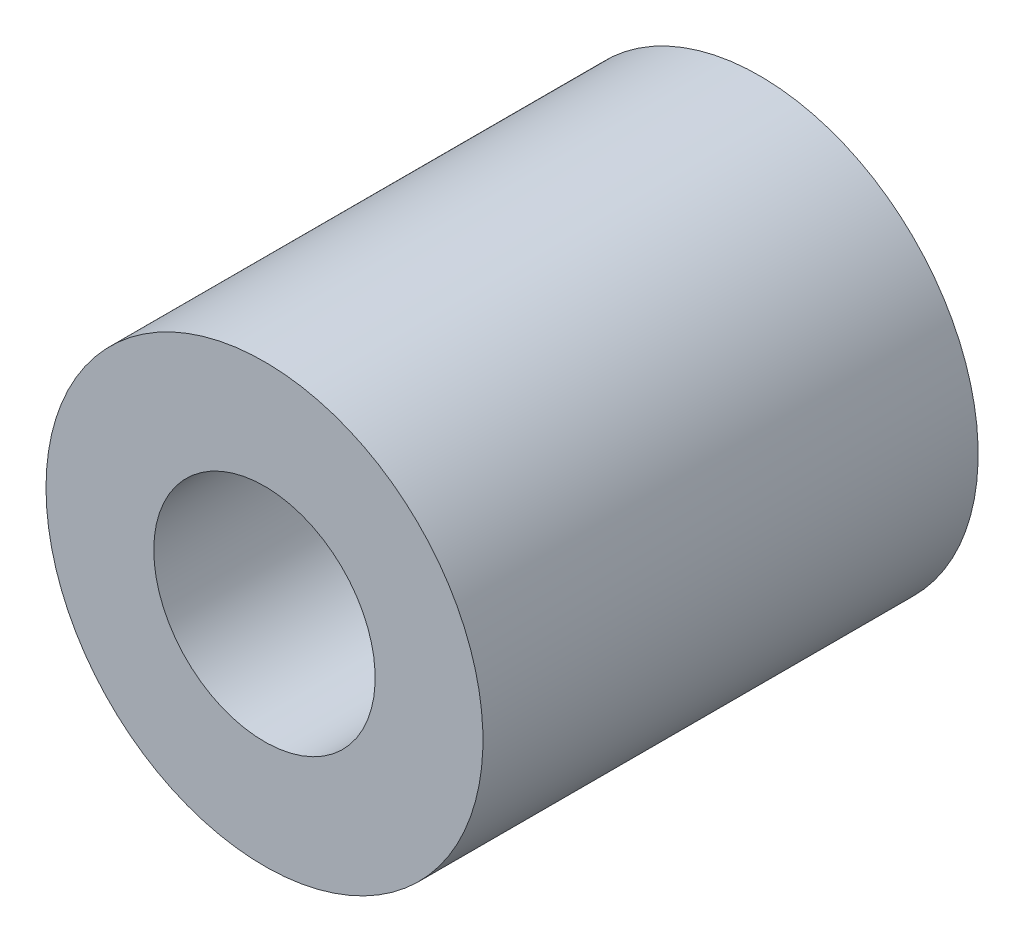
ISO-10303-21;
HEADER;
FILE_DESCRIPTION(('STEP AP214'),'2;1');
FILE_NAME('part.step','',(''),(''),'','','');
FILE_SCHEMA(('AUTOMOTIVE_DESIGN { 1 0 10303 214 1 1 1 1 }'));
ENDSEC;
DATA;
#1=APPLICATION_CONTEXT('core data for automotive mechanical design processes');
#2=APPLICATION_PROTOCOL_DEFINITION('international standard','automotive_design',2000,#1);
#3=PRODUCT_CONTEXT('',#1,'mechanical');
#4=PRODUCT('Part','Part','',(#3));
#5=PRODUCT_RELATED_PRODUCT_CATEGORY('part','',(#4));
#6=PRODUCT_DEFINITION_FORMATION('','',#4);
#7=PRODUCT_DEFINITION_CONTEXT('part definition',#1,'design');
#8=PRODUCT_DEFINITION('design','',#6,#7);
#9=PRODUCT_DEFINITION_SHAPE('','',#8);
#10=(LENGTH_UNIT() NAMED_UNIT(*) SI_UNIT(.MILLI.,.METRE.));
#11=(NAMED_UNIT(*) PLANE_ANGLE_UNIT() SI_UNIT($,.RADIAN.));
#12=(NAMED_UNIT(*) SI_UNIT($,.STERADIAN.) SOLID_ANGLE_UNIT());
#13=UNCERTAINTY_MEASURE_WITH_UNIT(LENGTH_MEASURE(1.E-05),#10,'distance_accuracy_value','');
#14=(GEOMETRIC_REPRESENTATION_CONTEXT(3) GLOBAL_UNCERTAINTY_ASSIGNED_CONTEXT((#13)) GLOBAL_UNIT_ASSIGNED_CONTEXT((#10,
#11,#12)) REPRESENTATION_CONTEXT('',''));
#15=CARTESIAN_POINT('',(0.,0.,0.));
#16=DIRECTION('',(0.,0.,1.));
#17=DIRECTION('',(1.,0.,0.));
#18=AXIS2_PLACEMENT_3D('',#15,#16,#17);
#19=CARTESIAN_POINT('',(0.,0.,21.59));
#20=DIRECTION('',(0.,0.,-1.));
#21=DIRECTION('',(-1.,0.,0.));
#22=AXIS2_PLACEMENT_3D('',#19,#20,#21);
#23=CYLINDRICAL_SURFACE('',#22,4.826);
#24=CARTESIAN_POINT('',(0.,0.,0.));
#25=DIRECTION('',(0.,0.,-1.));
#26=DIRECTION('',(-1.,0.,0.));
#27=AXIS2_PLACEMENT_3D('',#24,#25,#26);
#28=CIRCLE('',#27,4.826);
#29=CARTESIAN_POINT('',(-4.826,0.,0.));
#30=VERTEX_POINT('',#29);
#31=EDGE_CURVE('E26',#30,#30,#28,.T.);
#32=ORIENTED_EDGE('',*,*,#31,.T.);
#33=EDGE_LOOP('',(#32));
#34=FACE_BOUND('',#33,.T.);
#35=CARTESIAN_POINT('',(0.,0.,21.59));
#36=DIRECTION('',(0.,0.,-1.));
#37=DIRECTION('',(-1.,0.,0.));
#38=AXIS2_PLACEMENT_3D('',#35,#36,#37);
#39=CIRCLE('',#38,4.826);
#40=CARTESIAN_POINT('',(-4.826,0.,21.59));
#41=VERTEX_POINT('',#40);
#42=EDGE_CURVE('E17',#41,#41,#39,.T.);
#43=ORIENTED_EDGE('',*,*,#42,.F.);
#44=EDGE_LOOP('',(#43));
#45=FACE_BOUND('',#44,.T.);
#46=ADVANCED_FACE('F14',(#34,#45),#23,.F.);
#47=CARTESIAN_POINT('',(0.,0.,21.59));
#48=DIRECTION('',(0.,0.,1.));
#49=DIRECTION('',(1.,0.,0.));
#50=AXIS2_PLACEMENT_3D('',#47,#48,#49);
#51=PLANE('',#50);
#52=ORIENTED_EDGE('',*,*,#42,.T.);
#53=EDGE_LOOP('',(#52));
#54=FACE_BOUND('',#53,.T.);
#55=CARTESIAN_POINT('',(0.,0.,21.59));
#56=DIRECTION('',(0.,0.,-1.));
#57=DIRECTION('',(-1.,0.,0.));
#58=AXIS2_PLACEMENT_3D('',#55,#56,#57);
#59=CIRCLE('',#58,9.525);
#60=CARTESIAN_POINT('',(-9.525,0.,21.59));
#61=VERTEX_POINT('',#60);
#62=EDGE_CURVE('E21',#61,#61,#59,.T.);
#63=ORIENTED_EDGE('',*,*,#62,.F.);
#64=EDGE_LOOP('',(#63));
#65=FACE_BOUND('',#64,.T.);
#66=ADVANCED_FACE('F34',(#54,#65),#51,.T.);
#67=CARTESIAN_POINT('',(0.,0.,0.));
#68=DIRECTION('',(0.,0.,1.));
#69=DIRECTION('',(1.,0.,0.));
#70=AXIS2_PLACEMENT_3D('',#67,#68,#69);
#71=PLANE('',#70);
#72=ORIENTED_EDGE('',*,*,#31,.F.);
#73=EDGE_LOOP('',(#72));
#74=FACE_BOUND('',#73,.T.);
#75=CARTESIAN_POINT('',(0.,0.,0.));
#76=DIRECTION('',(0.,0.,-1.));
#77=DIRECTION('',(-1.,0.,0.));
#78=AXIS2_PLACEMENT_3D('',#75,#76,#77);
#79=CIRCLE('',#78,9.525);
#80=CARTESIAN_POINT('',(-9.525,0.,0.));
#81=VERTEX_POINT('',#80);
#82=EDGE_CURVE('E10',#81,#81,#79,.F.);
#83=ORIENTED_EDGE('',*,*,#82,.F.);
#84=EDGE_LOOP('',(#83));
#85=FACE_BOUND('',#84,.T.);
#86=ADVANCED_FACE('F42',(#74,#85),#71,.F.);
#87=CARTESIAN_POINT('',(0.,0.,21.59));
#88=DIRECTION('',(0.,0.,-1.));
#89=DIRECTION('',(-1.,0.,0.));
#90=AXIS2_PLACEMENT_3D('',#87,#88,#89);
#91=CYLINDRICAL_SURFACE('',#90,9.525);
#92=ORIENTED_EDGE('',*,*,#82,.T.);
#93=EDGE_LOOP('',(#92));
#94=FACE_BOUND('',#93,.T.);
#95=ORIENTED_EDGE('',*,*,#62,.T.);
#96=EDGE_LOOP('',(#95));
#97=FACE_BOUND('',#96,.T.);
#98=ADVANCED_FACE('F43',(#94,#97),#91,.T.);
#99=CLOSED_SHELL('',(#46,#66,#86,#98));
#100=MANIFOLD_SOLID_BREP('B1',#99);
#101=ADVANCED_BREP_SHAPE_REPRESENTATION('',(#18,#100),#14);
#102=SHAPE_DEFINITION_REPRESENTATION(#9,#101);
ENDSEC;
END-ISO-10303-21;
